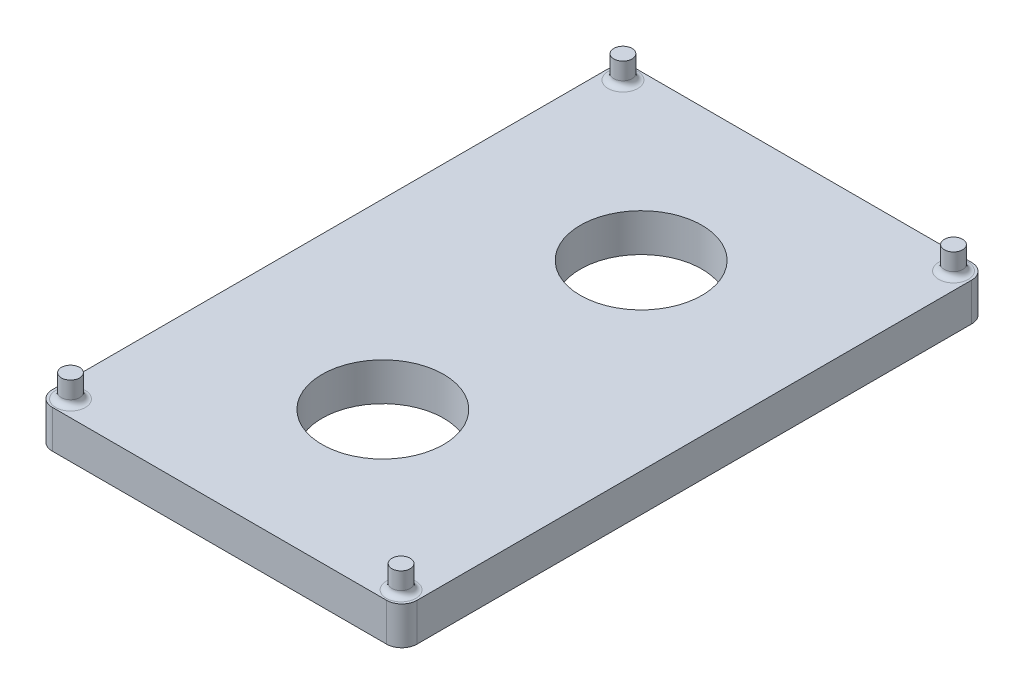
ISO-10303-21;
HEADER;
FILE_DESCRIPTION(('STEP AP214'),'2;1');
FILE_NAME('part.step','',(''),(''),'','','');
FILE_SCHEMA(('AUTOMOTIVE_DESIGN { 1 0 10303 214 1 1 1 1 }'));
ENDSEC;
DATA;
#1=APPLICATION_CONTEXT('core data for automotive mechanical design processes');
#2=APPLICATION_PROTOCOL_DEFINITION('international standard','automotive_design',2000,#1);
#3=PRODUCT_CONTEXT('',#1,'mechanical');
#4=PRODUCT('Part','Part','',(#3));
#5=PRODUCT_RELATED_PRODUCT_CATEGORY('part','',(#4));
#6=PRODUCT_DEFINITION_FORMATION('','',#4);
#7=PRODUCT_DEFINITION_CONTEXT('part definition',#1,'design');
#8=PRODUCT_DEFINITION('design','',#6,#7);
#9=PRODUCT_DEFINITION_SHAPE('','',#8);
#10=(LENGTH_UNIT() NAMED_UNIT(*) SI_UNIT(.MILLI.,.METRE.));
#11=(NAMED_UNIT(*) PLANE_ANGLE_UNIT() SI_UNIT($,.RADIAN.));
#12=(NAMED_UNIT(*) SI_UNIT($,.STERADIAN.) SOLID_ANGLE_UNIT());
#13=UNCERTAINTY_MEASURE_WITH_UNIT(LENGTH_MEASURE(1.E-05),#10,'distance_accuracy_value','');
#14=(GEOMETRIC_REPRESENTATION_CONTEXT(3) GLOBAL_UNCERTAINTY_ASSIGNED_CONTEXT((#13)) GLOBAL_UNIT_ASSIGNED_CONTEXT((#10,
#11,#12)) REPRESENTATION_CONTEXT('',''));
#15=CARTESIAN_POINT('',(0.,0.,0.));
#16=DIRECTION('',(0.,0.,1.));
#17=DIRECTION('',(1.,0.,0.));
#18=AXIS2_PLACEMENT_3D('',#15,#16,#17);
#19=CARTESIAN_POINT('',(0.,5.,0.));
#20=DIRECTION('',(0.,1.,0.));
#21=DIRECTION('',(0.,0.,1.));
#22=AXIS2_PLACEMENT_3D('',#19,#20,#21);
#23=PLANE('',#22);
#24=CARTESIAN_POINT('',(1.91043233082643,5.,13.645160810546));
#25=DIRECTION('',(0.,1.,0.));
#26=DIRECTION('',(0.,0.,-1.));
#27=AXIS2_PLACEMENT_3D('',#24,#25,#26);
#28=CIRCLE('',#27,8.);
#29=CARTESIAN_POINT('',(1.91043233082643,5.,5.64516081054603));
#30=VERTEX_POINT('',#29);
#31=EDGE_CURVE('E218',#30,#30,#28,.T.);
#32=ORIENTED_EDGE('',*,*,#31,.F.);
#33=EDGE_LOOP('',(#32));
#34=FACE_BOUND('',#33,.T.);
#35=CARTESIAN_POINT('',(1.91043233082643,5.,-20.344226445701));
#36=DIRECTION('',(0.,1.,0.));
#37=DIRECTION('',(0.,0.,1.));
#38=AXIS2_PLACEMENT_3D('',#35,#36,#37);
#39=CIRCLE('',#38,8.);
#40=CARTESIAN_POINT('',(1.91043233082643,5.,-12.344226445701));
#41=VERTEX_POINT('',#40);
#42=EDGE_CURVE('E212',#41,#41,#39,.T.);
#43=ORIENTED_EDGE('',*,*,#42,.F.);
#44=EDGE_LOOP('',(#43));
#45=FACE_BOUND('',#44,.T.);
#46=CARTESIAN_POINT('',(-19.8395676691728,5.,33.0004671824225));
#47=DIRECTION('',(0.,1.,0.));
#48=DIRECTION('',(0.,0.,1.));
#49=AXIS2_PLACEMENT_3D('',#46,#47,#48);
#50=CIRCLE('',#49,1.95);
#51=CARTESIAN_POINT('',(-19.8395676691728,5.,34.9504671824225));
#52=VERTEX_POINT('',#51);
#53=EDGE_CURVE('E150',#52,#52,#50,.F.);
#54=ORIENTED_EDGE('',*,*,#53,.T.);
#55=EDGE_LOOP('',(#54));
#56=FACE_BOUND('',#55,.T.);
#57=CARTESIAN_POINT('',(23.6604323308272,5.,33.0004671824225));
#58=DIRECTION('',(0.,1.,0.));
#59=DIRECTION('',(0.,0.,1.));
#60=AXIS2_PLACEMENT_3D('',#57,#58,#59);
#61=CIRCLE('',#60,1.95);
#62=CARTESIAN_POINT('',(23.6604323308272,5.,34.9504671824225));
#63=VERTEX_POINT('',#62);
#64=EDGE_CURVE('E147',#63,#63,#61,.F.);
#65=ORIENTED_EDGE('',*,*,#64,.T.);
#66=EDGE_LOOP('',(#65));
#67=FACE_BOUND('',#66,.T.);
#68=CARTESIAN_POINT('',(23.6604323308264,5.,-39.6995328175775));
#69=DIRECTION('',(0.,1.,0.));
#70=DIRECTION('',(0.,0.,1.));
#71=AXIS2_PLACEMENT_3D('',#68,#69,#70);
#72=CIRCLE('',#71,1.95);
#73=CARTESIAN_POINT('',(23.6604323308264,5.,-37.7495328175775));
#74=VERTEX_POINT('',#73);
#75=EDGE_CURVE('E144',#74,#74,#72,.F.);
#76=ORIENTED_EDGE('',*,*,#75,.T.);
#77=EDGE_LOOP('',(#76));
#78=FACE_BOUND('',#77,.T.);
#79=CARTESIAN_POINT('',(-19.8395676691736,5.,-39.6995328175775));
#80=DIRECTION('',(0.,1.,0.));
#81=DIRECTION('',(0.,0.,1.));
#82=AXIS2_PLACEMENT_3D('',#79,#80,#81);
#83=CIRCLE('',#82,1.95);
#84=CARTESIAN_POINT('',(-19.8395676691736,5.,-37.7495328175775));
#85=VERTEX_POINT('',#84);
#86=EDGE_CURVE('E140',#85,#85,#83,.F.);
#87=ORIENTED_EDGE('',*,*,#86,.T.);
#88=EDGE_LOOP('',(#87));
#89=FACE_BOUND('',#88,.T.);
#90=DIRECTION('',(0.,0.,1.));
#91=VECTOR('',#90,1.);
#92=CARTESIAN_POINT('',(-22.0895676691736,5.,-41.8495328175775));
#93=LINE('',#92,#91);
#94=CARTESIAN_POINT('',(-22.0895676691736,5.,-39.8495328175775));
#95=VERTEX_POINT('',#94);
#96=CARTESIAN_POINT('',(-22.0895676691736,5.,33.1504671824225));
#97=VERTEX_POINT('',#96);
#98=EDGE_CURVE('E136',#95,#97,#93,.T.);
#99=ORIENTED_EDGE('',*,*,#98,.T.);
#100=CARTESIAN_POINT('',(-20.0895676691736,5.,33.1504671824225));
#101=DIRECTION('',(0.,1.,0.));
#102=DIRECTION('',(0.,0.,1.));
#103=AXIS2_PLACEMENT_3D('',#100,#101,#102);
#104=CIRCLE('',#103,2.);
#105=CARTESIAN_POINT('',(-20.0895676691736,5.,35.1504671824225));
#106=VERTEX_POINT('',#105);
#107=EDGE_CURVE('E175',#97,#106,#104,.T.);
#108=ORIENTED_EDGE('',*,*,#107,.T.);
#109=DIRECTION('',(1.,0.,0.));
#110=VECTOR('',#109,1.);
#111=CARTESIAN_POINT('',(-22.0895676691736,5.,35.1504671824225));
#112=LINE('',#111,#110);
#113=CARTESIAN_POINT('',(23.9104323308264,5.,35.1504671824225));
#114=VERTEX_POINT('',#113);
#115=EDGE_CURVE('E119',#106,#114,#112,.T.);
#116=ORIENTED_EDGE('',*,*,#115,.T.);
#117=CARTESIAN_POINT('',(23.9104323308264,5.,33.1504671824225));
#118=DIRECTION('',(0.,1.,0.));
#119=DIRECTION('',(0.,0.,1.));
#120=AXIS2_PLACEMENT_3D('',#117,#118,#119);
#121=CIRCLE('',#120,2.);
#122=CARTESIAN_POINT('',(25.9104323308264,5.,33.1504671824225));
#123=VERTEX_POINT('',#122);
#124=EDGE_CURVE('E173',#114,#123,#121,.T.);
#125=ORIENTED_EDGE('',*,*,#124,.T.);
#126=DIRECTION('',(0.,0.,-1.));
#127=VECTOR('',#126,1.);
#128=CARTESIAN_POINT('',(25.9104323308264,5.,-41.8495328175775));
#129=LINE('',#128,#127);
#130=CARTESIAN_POINT('',(25.9104323308264,5.,-39.8495328175775));
#131=VERTEX_POINT('',#130);
#132=EDGE_CURVE('E186',#123,#131,#129,.T.);
#133=ORIENTED_EDGE('',*,*,#132,.T.);
#134=CARTESIAN_POINT('',(23.9104323308264,5.,-39.8495328175775));
#135=DIRECTION('',(0.,1.,0.));
#136=DIRECTION('',(0.,0.,1.));
#137=AXIS2_PLACEMENT_3D('',#134,#135,#136);
#138=CIRCLE('',#137,2.);
#139=CARTESIAN_POINT('',(23.9104323308264,5.,-41.8495328175775));
#140=VERTEX_POINT('',#139);
#141=EDGE_CURVE('E54',#131,#140,#138,.T.);
#142=ORIENTED_EDGE('',*,*,#141,.T.);
#143=DIRECTION('',(-1.,0.,0.));
#144=VECTOR('',#143,1.);
#145=CARTESIAN_POINT('',(-22.0895676691736,5.,-41.8495328175775));
#146=LINE('',#145,#144);
#147=CARTESIAN_POINT('',(-20.0895676691736,5.,-41.8495328175775));
#148=VERTEX_POINT('',#147);
#149=EDGE_CURVE('E141',#140,#148,#146,.T.);
#150=ORIENTED_EDGE('',*,*,#149,.T.);
#151=CARTESIAN_POINT('',(-20.0895676691736,5.,-39.8495328175775));
#152=DIRECTION('',(0.,1.,0.));
#153=DIRECTION('',(0.,0.,1.));
#154=AXIS2_PLACEMENT_3D('',#151,#152,#153);
#155=CIRCLE('',#154,2.);
#156=EDGE_CURVE('E170',#148,#95,#155,.T.);
#157=ORIENTED_EDGE('',*,*,#156,.T.);
#158=EDGE_LOOP('',(#99,#108,#116,#125,#133,#142,#150,#157));
#159=FACE_BOUND('',#158,.T.);
#160=ADVANCED_FACE('F33',(#34,#45,#56,#67,#78,#89,#159),#23,.T.);
#161=CARTESIAN_POINT('',(-22.0895676691736,5.,-41.8495328175775));
#162=DIRECTION('',(1.,0.,0.));
#163=DIRECTION('',(0.,0.,-1.));
#164=AXIS2_PLACEMENT_3D('',#161,#162,#163);
#165=PLANE('',#164);
#166=DIRECTION('',(0.,0.,1.));
#167=VECTOR('',#166,1.);
#168=CARTESIAN_POINT('',(-22.0895676691736,0.,-41.8495328175775));
#169=LINE('',#168,#167);
#170=CARTESIAN_POINT('',(-22.0895676691736,0.,-39.8495328175775));
#171=VERTEX_POINT('',#170);
#172=CARTESIAN_POINT('',(-22.0895676691736,0.,33.1504671824225));
#173=VERTEX_POINT('',#172);
#174=EDGE_CURVE('E126',#171,#173,#169,.T.);
#175=ORIENTED_EDGE('',*,*,#174,.T.);
#176=DIRECTION('',(0.,-1.,0.));
#177=VECTOR('',#176,1.);
#178=CARTESIAN_POINT('',(-22.0895676691736,5.,33.1504671824225));
#179=LINE('',#178,#177);
#180=EDGE_CURVE('E104',#173,#97,#179,.F.);
#181=ORIENTED_EDGE('',*,*,#180,.T.);
#182=ORIENTED_EDGE('',*,*,#98,.F.);
#183=DIRECTION('',(0.,-1.,0.));
#184=VECTOR('',#183,1.);
#185=CARTESIAN_POINT('',(-22.0895676691736,5.,-39.8495328175775));
#186=LINE('',#185,#184);
#187=EDGE_CURVE('E109',#95,#171,#186,.T.);
#188=ORIENTED_EDGE('',*,*,#187,.T.);
#189=EDGE_LOOP('',(#175,#181,#182,#188));
#190=FACE_BOUND('',#189,.T.);
#191=ADVANCED_FACE('F235',(#190),#165,.F.);
#192=CARTESIAN_POINT('',(-22.0895676691736,5.,35.1504671824225));
#193=DIRECTION('',(0.,0.,-1.));
#194=DIRECTION('',(-1.,0.,0.));
#195=AXIS2_PLACEMENT_3D('',#192,#193,#194);
#196=PLANE('',#195);
#197=ORIENTED_EDGE('',*,*,#115,.F.);
#198=DIRECTION('',(0.,-1.,0.));
#199=VECTOR('',#198,1.);
#200=CARTESIAN_POINT('',(-20.0895676691736,5.,35.1504671824225));
#201=LINE('',#200,#199);
#202=CARTESIAN_POINT('',(-20.0895676691736,0.,35.1504671824225));
#203=VERTEX_POINT('',#202);
#204=EDGE_CURVE('E103',#106,#203,#201,.T.);
#205=ORIENTED_EDGE('',*,*,#204,.T.);
#206=DIRECTION('',(1.,0.,0.));
#207=VECTOR('',#206,1.);
#208=CARTESIAN_POINT('',(-22.0895676691736,0.,35.1504671824225));
#209=LINE('',#208,#207);
#210=CARTESIAN_POINT('',(23.9104323308264,0.,35.1504671824225));
#211=VERTEX_POINT('',#210);
#212=EDGE_CURVE('E116',#203,#211,#209,.T.);
#213=ORIENTED_EDGE('',*,*,#212,.T.);
#214=DIRECTION('',(0.,-1.,0.));
#215=VECTOR('',#214,1.);
#216=CARTESIAN_POINT('',(23.9104323308264,5.,35.1504671824225));
#217=LINE('',#216,#215);
#218=EDGE_CURVE('E121',#211,#114,#217,.F.);
#219=ORIENTED_EDGE('',*,*,#218,.T.);
#220=EDGE_LOOP('',(#197,#205,#213,#219));
#221=FACE_BOUND('',#220,.T.);
#222=ADVANCED_FACE('F115',(#221),#196,.F.);
#223=CARTESIAN_POINT('',(25.9104323308264,5.,-41.8495328175775));
#224=DIRECTION('',(-1.,0.,0.));
#225=DIRECTION('',(0.,0.,1.));
#226=AXIS2_PLACEMENT_3D('',#223,#224,#225);
#227=PLANE('',#226);
#228=ORIENTED_EDGE('',*,*,#132,.F.);
#229=DIRECTION('',(0.,-1.,0.));
#230=VECTOR('',#229,1.);
#231=CARTESIAN_POINT('',(25.9104323308264,5.,33.1504671824225));
#232=LINE('',#231,#230);
#233=CARTESIAN_POINT('',(25.9104323308264,0.,33.1504671824225));
#234=VERTEX_POINT('',#233);
#235=EDGE_CURVE('E179',#123,#234,#232,.T.);
#236=ORIENTED_EDGE('',*,*,#235,.T.);
#237=DIRECTION('',(0.,0.,-1.));
#238=VECTOR('',#237,1.);
#239=CARTESIAN_POINT('',(25.9104323308264,0.,-41.8495328175775));
#240=LINE('',#239,#238);
#241=CARTESIAN_POINT('',(25.9104323308264,0.,-39.8495328175775));
#242=VERTEX_POINT('',#241);
#243=EDGE_CURVE('E125',#234,#242,#240,.T.);
#244=ORIENTED_EDGE('',*,*,#243,.T.);
#245=DIRECTION('',(0.,-1.,0.));
#246=VECTOR('',#245,1.);
#247=CARTESIAN_POINT('',(25.9104323308264,5.,-39.8495328175775));
#248=LINE('',#247,#246);
#249=EDGE_CURVE('E177',#242,#131,#248,.F.);
#250=ORIENTED_EDGE('',*,*,#249,.T.);
#251=EDGE_LOOP('',(#228,#236,#244,#250));
#252=FACE_BOUND('',#251,.T.);
#253=ADVANCED_FACE('F184',(#252),#227,.F.);
#254=CARTESIAN_POINT('',(-22.0895676691736,5.,-41.8495328175775));
#255=DIRECTION('',(0.,0.,1.));
#256=DIRECTION('',(1.,0.,0.));
#257=AXIS2_PLACEMENT_3D('',#254,#255,#256);
#258=PLANE('',#257);
#259=ORIENTED_EDGE('',*,*,#149,.F.);
#260=DIRECTION('',(0.,-1.,0.));
#261=VECTOR('',#260,1.);
#262=CARTESIAN_POINT('',(23.9104323308264,5.,-41.8495328175775));
#263=LINE('',#262,#261);
#264=CARTESIAN_POINT('',(23.9104323308264,0.,-41.8495328175775));
#265=VERTEX_POINT('',#264);
#266=EDGE_CURVE('E11',#140,#265,#263,.T.);
#267=ORIENTED_EDGE('',*,*,#266,.T.);
#268=DIRECTION('',(-1.,0.,0.));
#269=VECTOR('',#268,1.);
#270=CARTESIAN_POINT('',(-22.0895676691736,0.,-41.8495328175775));
#271=LINE('',#270,#269);
#272=CARTESIAN_POINT('',(-20.0895676691736,0.,-41.8495328175775));
#273=VERTEX_POINT('',#272);
#274=EDGE_CURVE('E129',#265,#273,#271,.T.);
#275=ORIENTED_EDGE('',*,*,#274,.T.);
#276=DIRECTION('',(0.,-1.,0.));
#277=VECTOR('',#276,1.);
#278=CARTESIAN_POINT('',(-20.0895676691736,5.,-41.8495328175775));
#279=LINE('',#278,#277);
#280=EDGE_CURVE('E41',#273,#148,#279,.F.);
#281=ORIENTED_EDGE('',*,*,#280,.T.);
#282=EDGE_LOOP('',(#259,#267,#275,#281));
#283=FACE_BOUND('',#282,.T.);
#284=ADVANCED_FACE('F193',(#283),#258,.F.);
#285=CARTESIAN_POINT('',(0.,0.,0.));
#286=DIRECTION('',(0.,1.,0.));
#287=DIRECTION('',(0.,0.,1.));
#288=AXIS2_PLACEMENT_3D('',#285,#286,#287);
#289=PLANE('',#288);
#290=CARTESIAN_POINT('',(1.91043233082643,0.,13.645160810546));
#291=DIRECTION('',(0.,1.,0.));
#292=DIRECTION('',(0.,0.,-1.));
#293=AXIS2_PLACEMENT_3D('',#290,#291,#292);
#294=CIRCLE('',#293,8.);
#295=CARTESIAN_POINT('',(1.91043233082643,0.,5.64516081054603));
#296=VERTEX_POINT('',#295);
#297=EDGE_CURVE('E215',#296,#296,#294,.T.);
#298=ORIENTED_EDGE('',*,*,#297,.T.);
#299=EDGE_LOOP('',(#298));
#300=FACE_BOUND('',#299,.T.);
#301=CARTESIAN_POINT('',(1.91043233082643,0.,-20.344226445701));
#302=DIRECTION('',(0.,1.,0.));
#303=DIRECTION('',(0.,0.,1.));
#304=AXIS2_PLACEMENT_3D('',#301,#302,#303);
#305=CIRCLE('',#304,8.);
#306=CARTESIAN_POINT('',(1.91043233082643,0.,-12.344226445701));
#307=VERTEX_POINT('',#306);
#308=EDGE_CURVE('E211',#307,#307,#305,.T.);
#309=ORIENTED_EDGE('',*,*,#308,.T.);
#310=EDGE_LOOP('',(#309));
#311=FACE_BOUND('',#310,.T.);
#312=ORIENTED_EDGE('',*,*,#212,.F.);
#313=CARTESIAN_POINT('',(-20.0895676691736,0.,33.1504671824225));
#314=DIRECTION('',(0.,1.,0.));
#315=DIRECTION('',(0.,0.,1.));
#316=AXIS2_PLACEMENT_3D('',#313,#314,#315);
#317=CIRCLE('',#316,2.);
#318=EDGE_CURVE('E99',#203,#173,#317,.F.);
#319=ORIENTED_EDGE('',*,*,#318,.T.);
#320=ORIENTED_EDGE('',*,*,#174,.F.);
#321=CARTESIAN_POINT('',(-20.0895676691736,0.,-39.8495328175775));
#322=DIRECTION('',(0.,1.,0.));
#323=DIRECTION('',(0.,0.,1.));
#324=AXIS2_PLACEMENT_3D('',#321,#322,#323);
#325=CIRCLE('',#324,2.);
#326=EDGE_CURVE('E120',#171,#273,#325,.F.);
#327=ORIENTED_EDGE('',*,*,#326,.T.);
#328=ORIENTED_EDGE('',*,*,#274,.F.);
#329=CARTESIAN_POINT('',(23.9104323308264,0.,-39.8495328175775));
#330=DIRECTION('',(0.,1.,0.));
#331=DIRECTION('',(0.,0.,1.));
#332=AXIS2_PLACEMENT_3D('',#329,#330,#331);
#333=CIRCLE('',#332,2.);
#334=EDGE_CURVE('E164',#265,#242,#333,.F.);
#335=ORIENTED_EDGE('',*,*,#334,.T.);
#336=ORIENTED_EDGE('',*,*,#243,.F.);
#337=CARTESIAN_POINT('',(23.9104323308264,0.,33.1504671824225));
#338=DIRECTION('',(0.,1.,0.));
#339=DIRECTION('',(0.,0.,1.));
#340=AXIS2_PLACEMENT_3D('',#337,#338,#339);
#341=CIRCLE('',#340,2.);
#342=EDGE_CURVE('E110',#234,#211,#341,.F.);
#343=ORIENTED_EDGE('',*,*,#342,.T.);
#344=EDGE_LOOP('',(#312,#319,#320,#327,#328,#335,#336,#343));
#345=FACE_BOUND('',#344,.T.);
#346=ADVANCED_FACE('F123',(#300,#311,#345),#289,.F.);
#347=CARTESIAN_POINT('',(-19.8395676691736,8.,-39.6995328175775));
#348=DIRECTION('',(0.,-1.,0.));
#349=DIRECTION('',(0.,0.,-1.));
#350=AXIS2_PLACEMENT_3D('',#347,#348,#349);
#351=CYLINDRICAL_SURFACE('',#350,1.2);
#352=CARTESIAN_POINT('',(-19.8395676691736,5.75,-39.6995328175775));
#353=DIRECTION('',(0.,1.,0.));
#354=DIRECTION('',(0.,0.,1.));
#355=AXIS2_PLACEMENT_3D('',#352,#353,#354);
#356=CIRCLE('',#355,1.2);
#357=CARTESIAN_POINT('',(-19.8395676691736,5.75,-38.4995328175775));
#358=VERTEX_POINT('',#357);
#359=EDGE_CURVE('E159',#358,#358,#356,.T.);
#360=ORIENTED_EDGE('',*,*,#359,.T.);
#361=EDGE_LOOP('',(#360));
#362=FACE_BOUND('',#361,.T.);
#363=CARTESIAN_POINT('',(-19.8395676691736,8.,-39.6995328175775));
#364=DIRECTION('',(0.,1.,0.));
#365=DIRECTION('',(0.,0.,1.));
#366=AXIS2_PLACEMENT_3D('',#363,#364,#365);
#367=CIRCLE('',#366,1.2);
#368=CARTESIAN_POINT('',(-19.8395676691736,8.,-38.4995328175775));
#369=VERTEX_POINT('',#368);
#370=EDGE_CURVE('E131',#369,#369,#367,.T.);
#371=ORIENTED_EDGE('',*,*,#370,.F.);
#372=EDGE_LOOP('',(#371));
#373=FACE_BOUND('',#372,.T.);
#374=ADVANCED_FACE('F291',(#362,#373),#351,.T.);
#375=CARTESIAN_POINT('',(-19.8395676691736,8.,-39.6995328175775));
#376=DIRECTION('',(0.,1.,0.));
#377=DIRECTION('',(0.,0.,1.));
#378=AXIS2_PLACEMENT_3D('',#375,#376,#377);
#379=PLANE('',#378);
#380=ORIENTED_EDGE('',*,*,#370,.T.);
#381=EDGE_LOOP('',(#380));
#382=FACE_BOUND('',#381,.T.);
#383=ADVANCED_FACE('F295',(#382),#379,.T.);
#384=CARTESIAN_POINT('',(23.6604323308264,8.,-39.6995328175775));
#385=DIRECTION('',(0.,-1.,0.));
#386=DIRECTION('',(0.,0.,-1.));
#387=AXIS2_PLACEMENT_3D('',#384,#385,#386);
#388=CYLINDRICAL_SURFACE('',#387,1.2);
#389=CARTESIAN_POINT('',(23.6604323308264,5.75,-39.6995328175775));
#390=DIRECTION('',(0.,1.,0.));
#391=DIRECTION('',(0.,0.,1.));
#392=AXIS2_PLACEMENT_3D('',#389,#390,#391);
#393=CIRCLE('',#392,1.2);
#394=CARTESIAN_POINT('',(23.6604323308264,5.75,-38.4995328175775));
#395=VERTEX_POINT('',#394);
#396=EDGE_CURVE('E156',#395,#395,#393,.T.);
#397=ORIENTED_EDGE('',*,*,#396,.T.);
#398=EDGE_LOOP('',(#397));
#399=FACE_BOUND('',#398,.T.);
#400=CARTESIAN_POINT('',(23.6604323308264,8.,-39.6995328175775));
#401=DIRECTION('',(0.,1.,0.));
#402=DIRECTION('',(0.,0.,1.));
#403=AXIS2_PLACEMENT_3D('',#400,#401,#402);
#404=CIRCLE('',#403,1.2);
#405=CARTESIAN_POINT('',(23.6604323308264,8.,-38.4995328175775));
#406=VERTEX_POINT('',#405);
#407=EDGE_CURVE('E202',#406,#406,#404,.T.);
#408=ORIENTED_EDGE('',*,*,#407,.F.);
#409=EDGE_LOOP('',(#408));
#410=FACE_BOUND('',#409,.T.);
#411=ADVANCED_FACE('F299',(#399,#410),#388,.T.);
#412=CARTESIAN_POINT('',(23.6604323308264,8.,-39.6995328175775));
#413=DIRECTION('',(0.,1.,0.));
#414=DIRECTION('',(0.,0.,1.));
#415=AXIS2_PLACEMENT_3D('',#412,#413,#414);
#416=PLANE('',#415);
#417=ORIENTED_EDGE('',*,*,#407,.T.);
#418=EDGE_LOOP('',(#417));
#419=FACE_BOUND('',#418,.T.);
#420=ADVANCED_FACE('F303',(#419),#416,.T.);
#421=CARTESIAN_POINT('',(23.6604323308272,8.,33.0004671824225));
#422=DIRECTION('',(0.,-1.,0.));
#423=DIRECTION('',(0.,0.,-1.));
#424=AXIS2_PLACEMENT_3D('',#421,#422,#423);
#425=CYLINDRICAL_SURFACE('',#424,1.2);
#426=CARTESIAN_POINT('',(23.6604323308272,5.75,33.0004671824225));
#427=DIRECTION('',(0.,1.,0.));
#428=DIRECTION('',(0.,0.,1.));
#429=AXIS2_PLACEMENT_3D('',#426,#427,#428);
#430=CIRCLE('',#429,1.2);
#431=CARTESIAN_POINT('',(23.6604323308272,5.75,34.2004671824225));
#432=VERTEX_POINT('',#431);
#433=EDGE_CURVE('E153',#432,#432,#430,.T.);
#434=ORIENTED_EDGE('',*,*,#433,.T.);
#435=EDGE_LOOP('',(#434));
#436=FACE_BOUND('',#435,.T.);
#437=CARTESIAN_POINT('',(23.6604323308272,8.,33.0004671824225));
#438=DIRECTION('',(0.,1.,0.));
#439=DIRECTION('',(0.,0.,1.));
#440=AXIS2_PLACEMENT_3D('',#437,#438,#439);
#441=CIRCLE('',#440,1.2);
#442=CARTESIAN_POINT('',(23.6604323308272,8.,34.2004671824225));
#443=VERTEX_POINT('',#442);
#444=EDGE_CURVE('E205',#443,#443,#441,.T.);
#445=ORIENTED_EDGE('',*,*,#444,.F.);
#446=EDGE_LOOP('',(#445));
#447=FACE_BOUND('',#446,.T.);
#448=ADVANCED_FACE('F307',(#436,#447),#425,.T.);
#449=CARTESIAN_POINT('',(23.6604323308272,8.,33.0004671824225));
#450=DIRECTION('',(0.,1.,0.));
#451=DIRECTION('',(0.,0.,1.));
#452=AXIS2_PLACEMENT_3D('',#449,#450,#451);
#453=PLANE('',#452);
#454=ORIENTED_EDGE('',*,*,#444,.T.);
#455=EDGE_LOOP('',(#454));
#456=FACE_BOUND('',#455,.T.);
#457=ADVANCED_FACE('F311',(#456),#453,.T.);
#458=CARTESIAN_POINT('',(-19.8395676691728,8.,33.0004671824225));
#459=DIRECTION('',(0.,-1.,0.));
#460=DIRECTION('',(0.,0.,-1.));
#461=AXIS2_PLACEMENT_3D('',#458,#459,#460);
#462=CYLINDRICAL_SURFACE('',#461,1.2);
#463=CARTESIAN_POINT('',(-19.8395676691728,5.75,33.0004671824225));
#464=DIRECTION('',(0.,1.,0.));
#465=DIRECTION('',(0.,0.,1.));
#466=AXIS2_PLACEMENT_3D('',#463,#464,#465);
#467=CIRCLE('',#466,1.2);
#468=CARTESIAN_POINT('',(-19.8395676691728,5.75,34.2004671824225));
#469=VERTEX_POINT('',#468);
#470=EDGE_CURVE('E137',#469,#469,#467,.T.);
#471=ORIENTED_EDGE('',*,*,#470,.T.);
#472=EDGE_LOOP('',(#471));
#473=FACE_BOUND('',#472,.T.);
#474=CARTESIAN_POINT('',(-19.8395676691728,8.,33.0004671824225));
#475=DIRECTION('',(0.,1.,0.));
#476=DIRECTION('',(0.,0.,1.));
#477=AXIS2_PLACEMENT_3D('',#474,#475,#476);
#478=CIRCLE('',#477,1.2);
#479=CARTESIAN_POINT('',(-19.8395676691728,8.,34.2004671824225));
#480=VERTEX_POINT('',#479);
#481=EDGE_CURVE('E208',#480,#480,#478,.T.);
#482=ORIENTED_EDGE('',*,*,#481,.F.);
#483=EDGE_LOOP('',(#482));
#484=FACE_BOUND('',#483,.T.);
#485=ADVANCED_FACE('F315',(#473,#484),#462,.T.);
#486=CARTESIAN_POINT('',(-19.8395676691728,8.,33.0004671824225));
#487=DIRECTION('',(0.,1.,0.));
#488=DIRECTION('',(0.,0.,1.));
#489=AXIS2_PLACEMENT_3D('',#486,#487,#488);
#490=PLANE('',#489);
#491=ORIENTED_EDGE('',*,*,#481,.T.);
#492=EDGE_LOOP('',(#491));
#493=FACE_BOUND('',#492,.T.);
#494=ADVANCED_FACE('F280',(#493),#490,.T.);
#495=CARTESIAN_POINT('',(-19.8395676691728,5.75,33.0004671824225));
#496=DIRECTION('',(0.,1.,0.));
#497=DIRECTION('',(0.,0.,1.));
#498=AXIS2_PLACEMENT_3D('',#495,#496,#497);
#499=TOROIDAL_SURFACE('',#498,1.95,0.75);
#500=ORIENTED_EDGE('',*,*,#53,.F.);
#501=EDGE_LOOP('',(#500));
#502=FACE_BOUND('',#501,.T.);
#503=ORIENTED_EDGE('',*,*,#470,.F.);
#504=EDGE_LOOP('',(#503));
#505=FACE_BOUND('',#504,.T.);
#506=ADVANCED_FACE('F276',(#502,#505),#499,.F.);
#507=CARTESIAN_POINT('',(23.6604323308272,5.75,33.0004671824225));
#508=DIRECTION('',(0.,1.,0.));
#509=DIRECTION('',(0.,0.,1.));
#510=AXIS2_PLACEMENT_3D('',#507,#508,#509);
#511=TOROIDAL_SURFACE('',#510,1.95,0.75);
#512=ORIENTED_EDGE('',*,*,#64,.F.);
#513=EDGE_LOOP('',(#512));
#514=FACE_BOUND('',#513,.T.);
#515=ORIENTED_EDGE('',*,*,#433,.F.);
#516=EDGE_LOOP('',(#515));
#517=FACE_BOUND('',#516,.T.);
#518=ADVANCED_FACE('F272',(#514,#517),#511,.F.);
#519=CARTESIAN_POINT('',(23.6604323308264,5.75,-39.6995328175775));
#520=DIRECTION('',(0.,1.,0.));
#521=DIRECTION('',(0.,0.,1.));
#522=AXIS2_PLACEMENT_3D('',#519,#520,#521);
#523=TOROIDAL_SURFACE('',#522,1.95,0.75);
#524=ORIENTED_EDGE('',*,*,#75,.F.);
#525=EDGE_LOOP('',(#524));
#526=FACE_BOUND('',#525,.T.);
#527=ORIENTED_EDGE('',*,*,#396,.F.);
#528=EDGE_LOOP('',(#527));
#529=FACE_BOUND('',#528,.T.);
#530=ADVANCED_FACE('F268',(#526,#529),#523,.F.);
#531=CARTESIAN_POINT('',(-19.8395676691736,5.75,-39.6995328175775));
#532=DIRECTION('',(0.,1.,0.));
#533=DIRECTION('',(0.,0.,1.));
#534=AXIS2_PLACEMENT_3D('',#531,#532,#533);
#535=TOROIDAL_SURFACE('',#534,1.95,0.75);
#536=ORIENTED_EDGE('',*,*,#86,.F.);
#537=EDGE_LOOP('',(#536));
#538=FACE_BOUND('',#537,.T.);
#539=ORIENTED_EDGE('',*,*,#359,.F.);
#540=EDGE_LOOP('',(#539));
#541=FACE_BOUND('',#540,.T.);
#542=ADVANCED_FACE('F265',(#538,#541),#535,.F.);
#543=CARTESIAN_POINT('',(-20.0895676691736,5.,33.1504671824225));
#544=DIRECTION('',(0.,-1.,0.));
#545=DIRECTION('',(0.,0.,-1.));
#546=AXIS2_PLACEMENT_3D('',#543,#544,#545);
#547=CYLINDRICAL_SURFACE('',#546,2.);
#548=ORIENTED_EDGE('',*,*,#107,.F.);
#549=ORIENTED_EDGE('',*,*,#180,.F.);
#550=ORIENTED_EDGE('',*,*,#318,.F.);
#551=ORIENTED_EDGE('',*,*,#204,.F.);
#552=EDGE_LOOP('',(#548,#549,#550,#551));
#553=FACE_BOUND('',#552,.T.);
#554=ADVANCED_FACE('F102',(#553),#547,.T.);
#555=CARTESIAN_POINT('',(23.9104323308264,5.,33.1504671824225));
#556=DIRECTION('',(0.,-1.,0.));
#557=DIRECTION('',(0.,0.,-1.));
#558=AXIS2_PLACEMENT_3D('',#555,#556,#557);
#559=CYLINDRICAL_SURFACE('',#558,2.);
#560=ORIENTED_EDGE('',*,*,#124,.F.);
#561=ORIENTED_EDGE('',*,*,#218,.F.);
#562=ORIENTED_EDGE('',*,*,#342,.F.);
#563=ORIENTED_EDGE('',*,*,#235,.F.);
#564=EDGE_LOOP('',(#560,#561,#562,#563));
#565=FACE_BOUND('',#564,.T.);
#566=ADVANCED_FACE('F257',(#565),#559,.T.);
#567=CARTESIAN_POINT('',(23.9104323308264,5.,-39.8495328175775));
#568=DIRECTION('',(0.,-1.,0.));
#569=DIRECTION('',(0.,0.,-1.));
#570=AXIS2_PLACEMENT_3D('',#567,#568,#569);
#571=CYLINDRICAL_SURFACE('',#570,2.);
#572=ORIENTED_EDGE('',*,*,#141,.F.);
#573=ORIENTED_EDGE('',*,*,#249,.F.);
#574=ORIENTED_EDGE('',*,*,#334,.F.);
#575=ORIENTED_EDGE('',*,*,#266,.F.);
#576=EDGE_LOOP('',(#572,#573,#574,#575));
#577=FACE_BOUND('',#576,.T.);
#578=ADVANCED_FACE('F192',(#577),#571,.T.);
#579=CARTESIAN_POINT('',(-20.0895676691736,5.,-39.8495328175775));
#580=DIRECTION('',(0.,-1.,0.));
#581=DIRECTION('',(0.,0.,-1.));
#582=AXIS2_PLACEMENT_3D('',#579,#580,#581);
#583=CYLINDRICAL_SURFACE('',#582,2.);
#584=ORIENTED_EDGE('',*,*,#156,.F.);
#585=ORIENTED_EDGE('',*,*,#280,.F.);
#586=ORIENTED_EDGE('',*,*,#326,.F.);
#587=ORIENTED_EDGE('',*,*,#187,.F.);
#588=EDGE_LOOP('',(#584,#585,#586,#587));
#589=FACE_BOUND('',#588,.T.);
#590=ADVANCED_FACE('F35',(#589),#583,.T.);
#591=CARTESIAN_POINT('',(1.91043233082643,0.,-20.344226445701));
#592=DIRECTION('',(0.,1.,0.));
#593=DIRECTION('',(0.,0.,1.));
#594=AXIS2_PLACEMENT_3D('',#591,#592,#593);
#595=CYLINDRICAL_SURFACE('',#594,8.);
#596=ORIENTED_EDGE('',*,*,#308,.F.);
#597=EDGE_LOOP('',(#596));
#598=FACE_BOUND('',#597,.T.);
#599=ORIENTED_EDGE('',*,*,#42,.T.);
#600=EDGE_LOOP('',(#599));
#601=FACE_BOUND('',#600,.T.);
#602=ADVANCED_FACE('F229',(#598,#601),#595,.F.);
#603=CARTESIAN_POINT('',(1.91043233082643,0.,13.645160810546));
#604=DIRECTION('',(0.,1.,0.));
#605=DIRECTION('',(0.,0.,1.));
#606=AXIS2_PLACEMENT_3D('',#603,#604,#605);
#607=CYLINDRICAL_SURFACE('',#606,8.);
#608=ORIENTED_EDGE('',*,*,#297,.F.);
#609=EDGE_LOOP('',(#608));
#610=FACE_BOUND('',#609,.T.);
#611=ORIENTED_EDGE('',*,*,#31,.T.);
#612=EDGE_LOOP('',(#611));
#613=FACE_BOUND('',#612,.T.);
#614=ADVANCED_FACE('F226',(#610,#613),#607,.F.);
#615=CLOSED_SHELL('',(#160,#191,#222,#253,#284,#346,#374,#383,#411,#420,#448,#457,#485,#494,
#506,#518,#530,#542,#554,#566,#578,#590,#602,#614));
#616=MANIFOLD_SOLID_BREP('B2',#615);
#617=ADVANCED_BREP_SHAPE_REPRESENTATION('',(#18,#616),#14);
#618=SHAPE_DEFINITION_REPRESENTATION(#9,#617);
ENDSEC;
END-ISO-10303-21;
